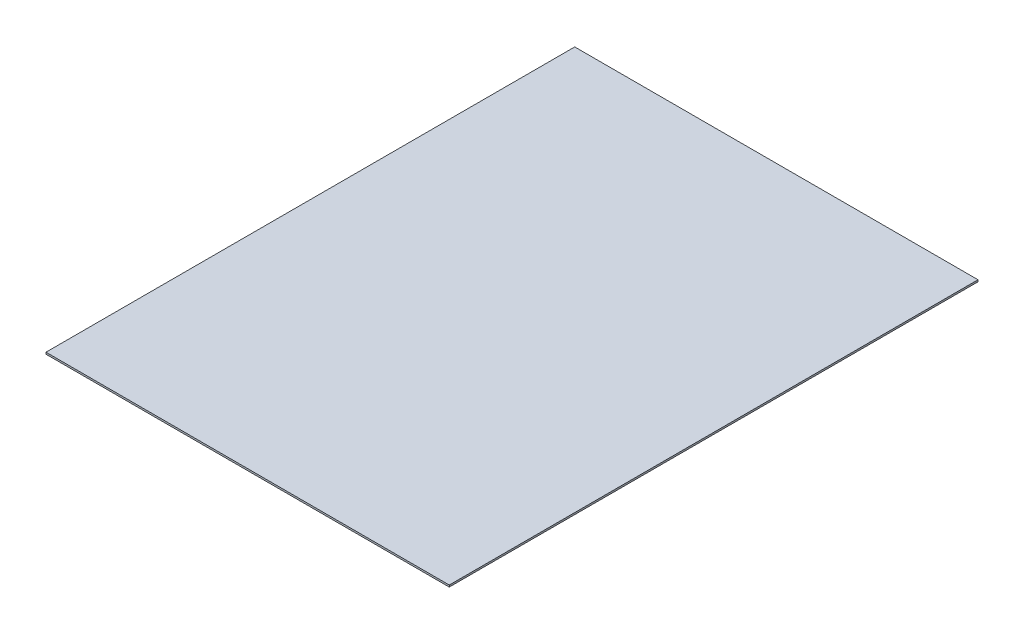
ISO-10303-21;
HEADER;
FILE_DESCRIPTION(('STEP AP214'),'2;1');
FILE_NAME('part.step','',(''),(''),'','','');
FILE_SCHEMA(('AUTOMOTIVE_DESIGN { 1 0 10303 214 1 1 1 1 }'));
ENDSEC;
DATA;
#1=APPLICATION_CONTEXT('core data for automotive mechanical design processes');
#2=APPLICATION_PROTOCOL_DEFINITION('international standard','automotive_design',2000,#1);
#3=PRODUCT_CONTEXT('',#1,'mechanical');
#4=PRODUCT('Part','Part','',(#3));
#5=PRODUCT_RELATED_PRODUCT_CATEGORY('part','',(#4));
#6=PRODUCT_DEFINITION_FORMATION('','',#4);
#7=PRODUCT_DEFINITION_CONTEXT('part definition',#1,'design');
#8=PRODUCT_DEFINITION('design','',#6,#7);
#9=PRODUCT_DEFINITION_SHAPE('','',#8);
#10=(LENGTH_UNIT() NAMED_UNIT(*) SI_UNIT(.MILLI.,.METRE.));
#11=(NAMED_UNIT(*) PLANE_ANGLE_UNIT() SI_UNIT($,.RADIAN.));
#12=(NAMED_UNIT(*) SI_UNIT($,.STERADIAN.) SOLID_ANGLE_UNIT());
#13=UNCERTAINTY_MEASURE_WITH_UNIT(LENGTH_MEASURE(1.E-05),#10,'distance_accuracy_value','');
#14=(GEOMETRIC_REPRESENTATION_CONTEXT(3) GLOBAL_UNCERTAINTY_ASSIGNED_CONTEXT((#13)) GLOBAL_UNIT_ASSIGNED_CONTEXT((#10,
#11,#12)) REPRESENTATION_CONTEXT('',''));
#15=CARTESIAN_POINT('',(0.,0.,0.));
#16=DIRECTION('',(0.,0.,1.));
#17=DIRECTION('',(1.,0.,0.));
#18=AXIS2_PLACEMENT_3D('',#15,#16,#17);
#19=CARTESIAN_POINT('',(225.,2.,295.));
#20=DIRECTION('',(-1.,0.,0.));
#21=DIRECTION('',(0.,0.,1.));
#22=AXIS2_PLACEMENT_3D('',#19,#20,#21);
#23=PLANE('',#22);
#24=DIRECTION('',(0.,0.,-1.));
#25=VECTOR('',#24,1.);
#26=CARTESIAN_POINT('',(225.,0.,295.));
#27=LINE('',#26,#25);
#28=CARTESIAN_POINT('',(225.,0.,295.));
#29=VERTEX_POINT('',#28);
#30=CARTESIAN_POINT('',(225.,0.,-295.));
#31=VERTEX_POINT('',#30);
#32=EDGE_CURVE('E98',#29,#31,#27,.T.);
#33=ORIENTED_EDGE('',*,*,#32,.T.);
#34=DIRECTION('',(0.,-1.,0.));
#35=VECTOR('',#34,1.);
#36=CARTESIAN_POINT('',(225.,2.,-295.));
#37=LINE('',#36,#35);
#38=CARTESIAN_POINT('',(225.,2.,-295.));
#39=VERTEX_POINT('',#38);
#40=EDGE_CURVE('E11',#39,#31,#37,.T.);
#41=ORIENTED_EDGE('',*,*,#40,.F.);
#42=DIRECTION('',(0.,0.,-1.));
#43=VECTOR('',#42,1.);
#44=CARTESIAN_POINT('',(225.,2.,295.));
#45=LINE('',#44,#43);
#46=CARTESIAN_POINT('',(225.,2.,295.));
#47=VERTEX_POINT('',#46);
#48=EDGE_CURVE('E86',#47,#39,#45,.T.);
#49=ORIENTED_EDGE('',*,*,#48,.F.);
#50=DIRECTION('',(0.,-1.,0.));
#51=VECTOR('',#50,1.);
#52=CARTESIAN_POINT('',(225.,2.,295.));
#53=LINE('',#52,#51);
#54=EDGE_CURVE('E94',#47,#29,#53,.T.);
#55=ORIENTED_EDGE('',*,*,#54,.T.);
#56=EDGE_LOOP('',(#33,#41,#49,#55));
#57=FACE_BOUND('',#56,.T.);
#58=ADVANCED_FACE('F35',(#57),#23,.F.);
#59=CARTESIAN_POINT('',(-225.,2.,-295.));
#60=DIRECTION('',(0.,0.,1.));
#61=DIRECTION('',(1.,0.,0.));
#62=AXIS2_PLACEMENT_3D('',#59,#60,#61);
#63=PLANE('',#62);
#64=DIRECTION('',(-1.,0.,0.));
#65=VECTOR('',#64,1.);
#66=CARTESIAN_POINT('',(-225.,0.,-295.));
#67=LINE('',#66,#65);
#68=CARTESIAN_POINT('',(-225.,0.,-295.));
#69=VERTEX_POINT('',#68);
#70=EDGE_CURVE('E90',#31,#69,#67,.T.);
#71=ORIENTED_EDGE('',*,*,#70,.T.);
#72=DIRECTION('',(0.,-1.,0.));
#73=VECTOR('',#72,1.);
#74=CARTESIAN_POINT('',(-225.,2.,-295.));
#75=LINE('',#74,#73);
#76=CARTESIAN_POINT('',(-225.,2.,-295.));
#77=VERTEX_POINT('',#76);
#78=EDGE_CURVE('E43',#77,#69,#75,.T.);
#79=ORIENTED_EDGE('',*,*,#78,.F.);
#80=DIRECTION('',(-1.,0.,0.));
#81=VECTOR('',#80,1.);
#82=CARTESIAN_POINT('',(-225.,2.,-295.));
#83=LINE('',#82,#81);
#84=EDGE_CURVE('E81',#39,#77,#83,.T.);
#85=ORIENTED_EDGE('',*,*,#84,.F.);
#86=ORIENTED_EDGE('',*,*,#40,.T.);
#87=EDGE_LOOP('',(#71,#79,#85,#86));
#88=FACE_BOUND('',#87,.T.);
#89=ADVANCED_FACE('F89',(#88),#63,.F.);
#90=CARTESIAN_POINT('',(-225.,2.,295.));
#91=DIRECTION('',(1.,0.,0.));
#92=DIRECTION('',(0.,0.,-1.));
#93=AXIS2_PLACEMENT_3D('',#90,#91,#92);
#94=PLANE('',#93);
#95=DIRECTION('',(0.,0.,1.));
#96=VECTOR('',#95,1.);
#97=CARTESIAN_POINT('',(-225.,0.,295.));
#98=LINE('',#97,#96);
#99=CARTESIAN_POINT('',(-225.,0.,295.));
#100=VERTEX_POINT('',#99);
#101=EDGE_CURVE('E68',#69,#100,#98,.T.);
#102=ORIENTED_EDGE('',*,*,#101,.T.);
#103=DIRECTION('',(0.,-1.,0.));
#104=VECTOR('',#103,1.);
#105=CARTESIAN_POINT('',(-225.,2.,295.));
#106=LINE('',#105,#104);
#107=CARTESIAN_POINT('',(-225.,2.,295.));
#108=VERTEX_POINT('',#107);
#109=EDGE_CURVE('E91',#108,#100,#106,.T.);
#110=ORIENTED_EDGE('',*,*,#109,.F.);
#111=DIRECTION('',(0.,0.,1.));
#112=VECTOR('',#111,1.);
#113=CARTESIAN_POINT('',(-225.,2.,295.));
#114=LINE('',#113,#112);
#115=EDGE_CURVE('E84',#77,#108,#114,.T.);
#116=ORIENTED_EDGE('',*,*,#115,.F.);
#117=ORIENTED_EDGE('',*,*,#78,.T.);
#118=EDGE_LOOP('',(#102,#110,#116,#117));
#119=FACE_BOUND('',#118,.T.);
#120=ADVANCED_FACE('F92',(#119),#94,.F.);
#121=CARTESIAN_POINT('',(-225.,2.,295.));
#122=DIRECTION('',(0.,0.,-1.));
#123=DIRECTION('',(-1.,0.,0.));
#124=AXIS2_PLACEMENT_3D('',#121,#122,#123);
#125=PLANE('',#124);
#126=DIRECTION('',(1.,0.,0.));
#127=VECTOR('',#126,1.);
#128=CARTESIAN_POINT('',(-225.,0.,295.));
#129=LINE('',#128,#127);
#130=EDGE_CURVE('E74',#100,#29,#129,.T.);
#131=ORIENTED_EDGE('',*,*,#130,.T.);
#132=ORIENTED_EDGE('',*,*,#54,.F.);
#133=DIRECTION('',(1.,0.,0.));
#134=VECTOR('',#133,1.);
#135=CARTESIAN_POINT('',(-225.,2.,295.));
#136=LINE('',#135,#134);
#137=EDGE_CURVE('E51',#108,#47,#136,.T.);
#138=ORIENTED_EDGE('',*,*,#137,.F.);
#139=ORIENTED_EDGE('',*,*,#109,.T.);
#140=EDGE_LOOP('',(#131,#132,#138,#139));
#141=FACE_BOUND('',#140,.T.);
#142=ADVANCED_FACE('F105',(#141),#125,.F.);
#143=CARTESIAN_POINT('',(0.,2.,0.));
#144=DIRECTION('',(0.,-1.,0.));
#145=DIRECTION('',(0.,0.,-1.));
#146=AXIS2_PLACEMENT_3D('',#143,#144,#145);
#147=PLANE('',#146);
#148=ORIENTED_EDGE('',*,*,#48,.T.);
#149=ORIENTED_EDGE('',*,*,#84,.T.);
#150=ORIENTED_EDGE('',*,*,#115,.T.);
#151=ORIENTED_EDGE('',*,*,#137,.T.);
#152=EDGE_LOOP('',(#148,#149,#150,#151));
#153=FACE_BOUND('',#152,.T.);
#154=ADVANCED_FACE('F82',(#153),#147,.F.);
#155=CARTESIAN_POINT('',(0.,0.,0.));
#156=DIRECTION('',(0.,-1.,0.));
#157=DIRECTION('',(0.,0.,-1.));
#158=AXIS2_PLACEMENT_3D('',#155,#156,#157);
#159=PLANE('',#158);
#160=ORIENTED_EDGE('',*,*,#32,.F.);
#161=ORIENTED_EDGE('',*,*,#130,.F.);
#162=ORIENTED_EDGE('',*,*,#101,.F.);
#163=ORIENTED_EDGE('',*,*,#70,.F.);
#164=EDGE_LOOP('',(#160,#161,#162,#163));
#165=FACE_BOUND('',#164,.T.);
#166=ADVANCED_FACE('F108',(#165),#159,.T.);
#167=CLOSED_SHELL('',(#58,#89,#120,#142,#154,#166));
#168=MANIFOLD_SOLID_BREP('B2',#167);
#169=ADVANCED_BREP_SHAPE_REPRESENTATION('',(#18,#168),#14);
#170=SHAPE_DEFINITION_REPRESENTATION(#9,#169);
ENDSEC;
END-ISO-10303-21;
